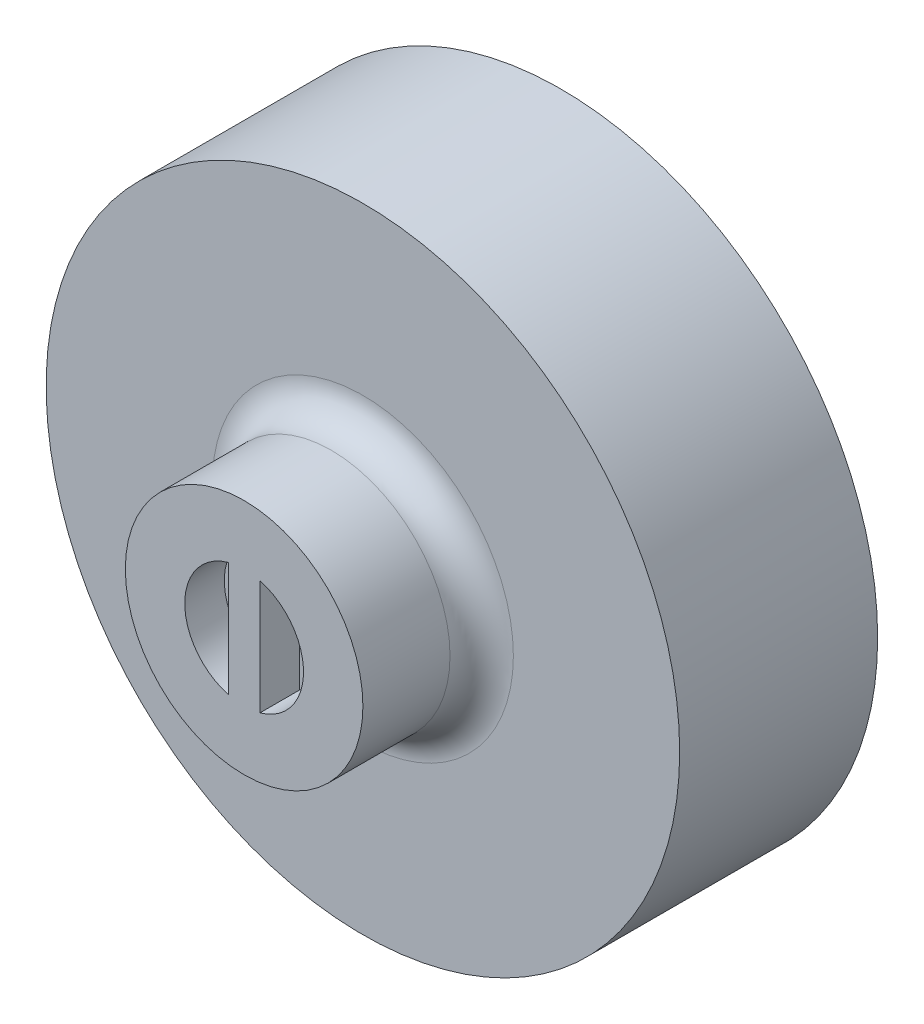
ISO-10303-21;
HEADER;
FILE_DESCRIPTION(('STEP AP214'),'2;1');
FILE_NAME('part.step','',(''),(''),'','','');
FILE_SCHEMA(('AUTOMOTIVE_DESIGN { 1 0 10303 214 1 1 1 1 }'));
ENDSEC;
DATA;
#1=APPLICATION_CONTEXT('core data for automotive mechanical design processes');
#2=APPLICATION_PROTOCOL_DEFINITION('international standard','automotive_design',2000,#1);
#3=PRODUCT_CONTEXT('',#1,'mechanical');
#4=PRODUCT('Part','Part','',(#3));
#5=PRODUCT_RELATED_PRODUCT_CATEGORY('part','',(#4));
#6=PRODUCT_DEFINITION_FORMATION('','',#4);
#7=PRODUCT_DEFINITION_CONTEXT('part definition',#1,'design');
#8=PRODUCT_DEFINITION('design','',#6,#7);
#9=PRODUCT_DEFINITION_SHAPE('','',#8);
#10=(LENGTH_UNIT() NAMED_UNIT(*) SI_UNIT(.MILLI.,.METRE.));
#11=(NAMED_UNIT(*) PLANE_ANGLE_UNIT() SI_UNIT($,.RADIAN.));
#12=(NAMED_UNIT(*) SI_UNIT($,.STERADIAN.) SOLID_ANGLE_UNIT());
#13=UNCERTAINTY_MEASURE_WITH_UNIT(LENGTH_MEASURE(1.E-05),#10,'distance_accuracy_value','');
#14=(GEOMETRIC_REPRESENTATION_CONTEXT(3) GLOBAL_UNCERTAINTY_ASSIGNED_CONTEXT((#13)) GLOBAL_UNIT_ASSIGNED_CONTEXT((#10,
#11,#12)) REPRESENTATION_CONTEXT('',''));
#15=CARTESIAN_POINT('',(0.,0.,0.));
#16=DIRECTION('',(0.,0.,1.));
#17=DIRECTION('',(1.,0.,0.));
#18=AXIS2_PLACEMENT_3D('',#15,#16,#17);
#19=CARTESIAN_POINT('',(0.,0.,-15.875));
#20=DIRECTION('',(0.,0.,1.));
#21=DIRECTION('',(1.,0.,0.));
#22=AXIS2_PLACEMENT_3D('',#19,#20,#21);
#23=CYLINDRICAL_SURFACE('',#22,25.4);
#24=CARTESIAN_POINT('',(0.,0.,-15.875));
#25=DIRECTION('',(0.,0.,1.));
#26=DIRECTION('',(1.,0.,0.));
#27=AXIS2_PLACEMENT_3D('',#24,#25,#26);
#28=CIRCLE('',#27,25.4);
#29=CARTESIAN_POINT('',(25.4,0.,-15.875));
#30=VERTEX_POINT('',#29);
#31=EDGE_CURVE('E135',#30,#30,#28,.T.);
#32=ORIENTED_EDGE('',*,*,#31,.T.);
#33=EDGE_LOOP('',(#32));
#34=FACE_BOUND('',#33,.T.);
#35=CARTESIAN_POINT('',(0.,0.,0.));
#36=DIRECTION('',(0.,0.,1.));
#37=DIRECTION('',(1.,0.,0.));
#38=AXIS2_PLACEMENT_3D('',#35,#36,#37);
#39=CIRCLE('',#38,25.4);
#40=CARTESIAN_POINT('',(25.4,0.,0.));
#41=VERTEX_POINT('',#40);
#42=EDGE_CURVE('E134',#41,#41,#39,.T.);
#43=ORIENTED_EDGE('',*,*,#42,.F.);
#44=EDGE_LOOP('',(#43));
#45=FACE_BOUND('',#44,.T.);
#46=ADVANCED_FACE('F42',(#34,#45),#23,.T.);
#47=CARTESIAN_POINT('',(0.,0.,-15.875));
#48=DIRECTION('',(0.,0.,1.));
#49=DIRECTION('',(1.,0.,0.));
#50=AXIS2_PLACEMENT_3D('',#47,#48,#49);
#51=PLANE('',#50);
#52=ORIENTED_EDGE('',*,*,#31,.F.);
#53=EDGE_LOOP('',(#52));
#54=FACE_BOUND('',#53,.T.);
#55=ADVANCED_FACE('F162',(#54),#51,.F.);
#56=CARTESIAN_POINT('',(0.,0.,0.));
#57=DIRECTION('',(0.,0.,1.));
#58=DIRECTION('',(1.,0.,0.));
#59=AXIS2_PLACEMENT_3D('',#56,#57,#58);
#60=PLANE('',#59);
#61=CARTESIAN_POINT('',(0.,0.,0.));
#62=DIRECTION('',(0.,0.,1.));
#63=DIRECTION('',(1.,0.,0.));
#64=AXIS2_PLACEMENT_3D('',#61,#62,#63);
#65=CIRCLE('',#64,12.065);
#66=CARTESIAN_POINT('',(12.065,0.,0.));
#67=VERTEX_POINT('',#66);
#68=EDGE_CURVE('E11',#67,#67,#65,.F.);
#69=ORIENTED_EDGE('',*,*,#68,.T.);
#70=EDGE_LOOP('',(#69));
#71=FACE_BOUND('',#70,.T.);
#72=ORIENTED_EDGE('',*,*,#42,.T.);
#73=EDGE_LOOP('',(#72));
#74=FACE_BOUND('',#73,.T.);
#75=ADVANCED_FACE('F167',(#71,#74),#60,.T.);
#76=CARTESIAN_POINT('',(0.,0.,9.525));
#77=DIRECTION('',(0.,0.,-1.));
#78=DIRECTION('',(-1.,0.,0.));
#79=AXIS2_PLACEMENT_3D('',#76,#77,#78);
#80=CYLINDRICAL_SURFACE('',#79,9.525);
#81=CARTESIAN_POINT('',(0.,0.,2.54));
#82=DIRECTION('',(0.,0.,1.));
#83=DIRECTION('',(1.,0.,0.));
#84=AXIS2_PLACEMENT_3D('',#81,#82,#83);
#85=CIRCLE('',#84,9.525);
#86=CARTESIAN_POINT('',(9.525,0.,2.54));
#87=VERTEX_POINT('',#86);
#88=EDGE_CURVE('E51',#87,#87,#85,.T.);
#89=ORIENTED_EDGE('',*,*,#88,.T.);
#90=EDGE_LOOP('',(#89));
#91=FACE_BOUND('',#90,.T.);
#92=CARTESIAN_POINT('',(0.,0.,9.525));
#93=DIRECTION('',(0.,0.,1.));
#94=DIRECTION('',(1.,0.,0.));
#95=AXIS2_PLACEMENT_3D('',#92,#93,#94);
#96=CIRCLE('',#95,9.525);
#97=CARTESIAN_POINT('',(9.525,0.,9.525));
#98=VERTEX_POINT('',#97);
#99=EDGE_CURVE('E109',#98,#98,#96,.T.);
#100=ORIENTED_EDGE('',*,*,#99,.F.);
#101=EDGE_LOOP('',(#100));
#102=FACE_BOUND('',#101,.T.);
#103=ADVANCED_FACE('F145',(#91,#102),#80,.T.);
#104=CARTESIAN_POINT('',(0.,0.,9.525));
#105=DIRECTION('',(0.,0.,1.));
#106=DIRECTION('',(1.,0.,0.));
#107=AXIS2_PLACEMENT_3D('',#104,#105,#106);
#108=PLANE('',#107);
#109=CARTESIAN_POINT('',(0.,0.,9.525));
#110=DIRECTION('',(0.,0.,1.));
#111=DIRECTION('',(1.,0.,0.));
#112=AXIS2_PLACEMENT_3D('',#109,#110,#111);
#113=CIRCLE('',#112,4.7625);
#114=CARTESIAN_POINT('',(1.27,-4.5900442535993,9.525));
#115=VERTEX_POINT('',#114);
#116=CARTESIAN_POINT('',(1.27,4.5900442535993,9.525));
#117=VERTEX_POINT('',#116);
#118=EDGE_CURVE('E58',#115,#117,#113,.T.);
#119=ORIENTED_EDGE('',*,*,#118,.F.);
#120=DIRECTION('',(0.,-1.,0.));
#121=VECTOR('',#120,1.);
#122=CARTESIAN_POINT('',(1.27,4.5900442535993,9.525));
#123=LINE('',#122,#121);
#124=EDGE_CURVE('E98',#117,#115,#123,.T.);
#125=ORIENTED_EDGE('',*,*,#124,.F.);
#126=EDGE_LOOP('',(#119,#125));
#127=FACE_BOUND('',#126,.T.);
#128=CARTESIAN_POINT('',(0.,0.,9.525));
#129=DIRECTION('',(0.,0.,1.));
#130=DIRECTION('',(1.,0.,0.));
#131=AXIS2_PLACEMENT_3D('',#128,#129,#130);
#132=CIRCLE('',#131,4.7625);
#133=CARTESIAN_POINT('',(-1.27,4.5900442535993,9.525));
#134=VERTEX_POINT('',#133);
#135=CARTESIAN_POINT('',(-1.27,-4.5900442535993,9.525));
#136=VERTEX_POINT('',#135);
#137=EDGE_CURVE('E66',#134,#136,#132,.T.);
#138=ORIENTED_EDGE('',*,*,#137,.F.);
#139=DIRECTION('',(0.,1.,0.));
#140=VECTOR('',#139,1.);
#141=CARTESIAN_POINT('',(-1.27,4.5900442535993,9.525));
#142=LINE('',#141,#140);
#143=EDGE_CURVE('E118',#136,#134,#142,.T.);
#144=ORIENTED_EDGE('',*,*,#143,.F.);
#145=EDGE_LOOP('',(#138,#144));
#146=FACE_BOUND('',#145,.T.);
#147=ORIENTED_EDGE('',*,*,#99,.T.);
#148=EDGE_LOOP('',(#147));
#149=FACE_BOUND('',#148,.T.);
#150=ADVANCED_FACE('F150',(#127,#146,#149),#108,.T.);
#151=CARTESIAN_POINT('',(0.,0.,2.54));
#152=DIRECTION('',(0.,0.,1.));
#153=DIRECTION('',(1.,0.,0.));
#154=AXIS2_PLACEMENT_3D('',#151,#152,#153);
#155=TOROIDAL_SURFACE('',#154,12.065,2.54);
#156=ORIENTED_EDGE('',*,*,#68,.F.);
#157=EDGE_LOOP('',(#156));
#158=FACE_BOUND('',#157,.T.);
#159=ORIENTED_EDGE('',*,*,#88,.F.);
#160=EDGE_LOOP('',(#159));
#161=FACE_BOUND('',#160,.T.);
#162=ADVANCED_FACE('F44',(#158,#161),#155,.F.);
#163=CARTESIAN_POINT('',(0.,0.,6.35));
#164=DIRECTION('',(0.,0.,1.));
#165=DIRECTION('',(1.,0.,0.));
#166=AXIS2_PLACEMENT_3D('',#163,#164,#165);
#167=CYLINDRICAL_SURFACE('',#166,4.7625);
#168=ORIENTED_EDGE('',*,*,#137,.T.);
#169=DIRECTION('',(0.,0.,1.));
#170=VECTOR('',#169,1.);
#171=CARTESIAN_POINT('',(-1.27,-4.5900442535993,6.35));
#172=LINE('',#171,#170);
#173=CARTESIAN_POINT('',(-1.27,-4.5900442535993,6.35));
#174=VERTEX_POINT('',#173);
#175=EDGE_CURVE('E111',#174,#136,#172,.T.);
#176=ORIENTED_EDGE('',*,*,#175,.F.);
#177=CARTESIAN_POINT('',(0.,0.,6.35));
#178=DIRECTION('',(0.,0.,1.));
#179=DIRECTION('',(1.,0.,0.));
#180=AXIS2_PLACEMENT_3D('',#177,#178,#179);
#181=CIRCLE('',#180,4.7625);
#182=CARTESIAN_POINT('',(-1.27,4.5900442535993,6.35));
#183=VERTEX_POINT('',#182);
#184=EDGE_CURVE('E122',#183,#174,#181,.T.);
#185=ORIENTED_EDGE('',*,*,#184,.F.);
#186=DIRECTION('',(0.,0.,1.));
#187=VECTOR('',#186,1.);
#188=CARTESIAN_POINT('',(-1.27,4.5900442535993,6.35));
#189=LINE('',#188,#187);
#190=EDGE_CURVE('E115',#183,#134,#189,.T.);
#191=ORIENTED_EDGE('',*,*,#190,.T.);
#192=EDGE_LOOP('',(#168,#176,#185,#191));
#193=FACE_BOUND('',#192,.T.);
#194=ADVANCED_FACE('F149',(#193),#167,.F.);
#195=CARTESIAN_POINT('',(-1.27,4.5900442535993,6.35));
#196=DIRECTION('',(1.,0.,0.));
#197=DIRECTION('',(0.,1.,0.));
#198=AXIS2_PLACEMENT_3D('',#195,#196,#197);
#199=PLANE('',#198);
#200=ORIENTED_EDGE('',*,*,#143,.T.);
#201=ORIENTED_EDGE('',*,*,#190,.F.);
#202=DIRECTION('',(0.,1.,0.));
#203=VECTOR('',#202,1.);
#204=CARTESIAN_POINT('',(-1.27,4.5900442535993,6.35));
#205=LINE('',#204,#203);
#206=EDGE_CURVE('E114',#174,#183,#205,.T.);
#207=ORIENTED_EDGE('',*,*,#206,.F.);
#208=ORIENTED_EDGE('',*,*,#175,.T.);
#209=EDGE_LOOP('',(#200,#201,#207,#208));
#210=FACE_BOUND('',#209,.T.);
#211=ADVANCED_FACE('F156',(#210),#199,.F.);
#212=CARTESIAN_POINT('',(0.,0.,6.35));
#213=DIRECTION('',(0.,0.,1.));
#214=DIRECTION('',(1.,0.,0.));
#215=AXIS2_PLACEMENT_3D('',#212,#213,#214);
#216=PLANE('',#215);
#217=ORIENTED_EDGE('',*,*,#184,.T.);
#218=ORIENTED_EDGE('',*,*,#206,.T.);
#219=EDGE_LOOP('',(#217,#218));
#220=FACE_BOUND('',#219,.T.);
#221=ADVANCED_FACE('F177',(#220),#216,.T.);
#222=CARTESIAN_POINT('',(0.,0.,6.35));
#223=DIRECTION('',(0.,0.,1.));
#224=DIRECTION('',(1.,0.,0.));
#225=AXIS2_PLACEMENT_3D('',#222,#223,#224);
#226=CYLINDRICAL_SURFACE('',#225,4.7625);
#227=ORIENTED_EDGE('',*,*,#118,.T.);
#228=DIRECTION('',(0.,0.,1.));
#229=VECTOR('',#228,1.);
#230=CARTESIAN_POINT('',(1.27,4.5900442535993,6.35));
#231=LINE('',#230,#229);
#232=CARTESIAN_POINT('',(1.27,4.5900442535993,6.35));
#233=VERTEX_POINT('',#232);
#234=EDGE_CURVE('E82',#233,#117,#231,.T.);
#235=ORIENTED_EDGE('',*,*,#234,.F.);
#236=CARTESIAN_POINT('',(0.,0.,6.35));
#237=DIRECTION('',(0.,0.,1.));
#238=DIRECTION('',(1.,0.,0.));
#239=AXIS2_PLACEMENT_3D('',#236,#237,#238);
#240=CIRCLE('',#239,4.7625);
#241=CARTESIAN_POINT('',(1.27,-4.5900442535993,6.35));
#242=VERTEX_POINT('',#241);
#243=EDGE_CURVE('E85',#242,#233,#240,.T.);
#244=ORIENTED_EDGE('',*,*,#243,.F.);
#245=DIRECTION('',(0.,0.,1.));
#246=VECTOR('',#245,1.);
#247=CARTESIAN_POINT('',(1.27,-4.5900442535993,6.35));
#248=LINE('',#247,#246);
#249=EDGE_CURVE('E92',#242,#115,#248,.T.);
#250=ORIENTED_EDGE('',*,*,#249,.T.);
#251=EDGE_LOOP('',(#227,#235,#244,#250));
#252=FACE_BOUND('',#251,.T.);
#253=ADVANCED_FACE('F84',(#252),#226,.F.);
#254=CARTESIAN_POINT('',(1.27,4.5900442535993,6.35));
#255=DIRECTION('',(-1.,0.,0.));
#256=DIRECTION('',(0.,-1.,0.));
#257=AXIS2_PLACEMENT_3D('',#254,#255,#256);
#258=PLANE('',#257);
#259=ORIENTED_EDGE('',*,*,#124,.T.);
#260=ORIENTED_EDGE('',*,*,#249,.F.);
#261=DIRECTION('',(0.,-1.,0.));
#262=VECTOR('',#261,1.);
#263=CARTESIAN_POINT('',(1.27,4.5900442535993,6.35));
#264=LINE('',#263,#262);
#265=EDGE_CURVE('E93',#233,#242,#264,.T.);
#266=ORIENTED_EDGE('',*,*,#265,.F.);
#267=ORIENTED_EDGE('',*,*,#234,.T.);
#268=EDGE_LOOP('',(#259,#260,#266,#267));
#269=FACE_BOUND('',#268,.T.);
#270=ADVANCED_FACE('F100',(#269),#258,.F.);
#271=CARTESIAN_POINT('',(0.,0.,6.35));
#272=DIRECTION('',(0.,0.,1.));
#273=DIRECTION('',(1.,0.,0.));
#274=AXIS2_PLACEMENT_3D('',#271,#272,#273);
#275=PLANE('',#274);
#276=ORIENTED_EDGE('',*,*,#243,.T.);
#277=ORIENTED_EDGE('',*,*,#265,.T.);
#278=EDGE_LOOP('',(#276,#277));
#279=FACE_BOUND('',#278,.T.);
#280=ADVANCED_FACE('F96',(#279),#275,.T.);
#281=CLOSED_SHELL('',(#46,#55,#75,#103,#150,#162,#194,#211,#221,#253,#270,#280));
#282=MANIFOLD_SOLID_BREP('B2',#281);
#283=ADVANCED_BREP_SHAPE_REPRESENTATION('',(#18,#282),#14);
#284=SHAPE_DEFINITION_REPRESENTATION(#9,#283);
ENDSEC;
END-ISO-10303-21;
